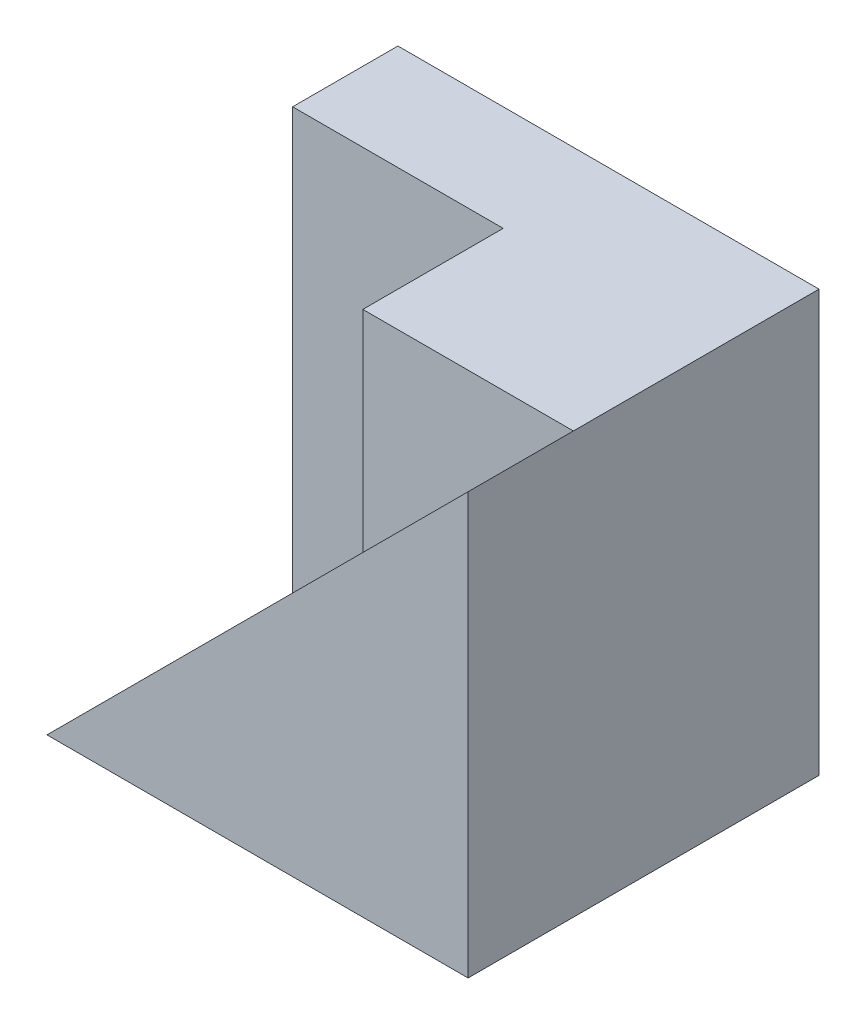
ISO-10303-21;
HEADER;
FILE_DESCRIPTION(('STEP AP214'),'2;1');
FILE_NAME('part.step','',(''),(''),'','','');
FILE_SCHEMA(('AUTOMOTIVE_DESIGN { 1 0 10303 214 1 1 1 1 }'));
ENDSEC;
DATA;
#1=APPLICATION_CONTEXT('core data for automotive mechanical design processes');
#2=APPLICATION_PROTOCOL_DEFINITION('international standard','automotive_design',2000,#1);
#3=PRODUCT_CONTEXT('',#1,'mechanical');
#4=PRODUCT('Part','Part','',(#3));
#5=PRODUCT_RELATED_PRODUCT_CATEGORY('part','',(#4));
#6=PRODUCT_DEFINITION_FORMATION('','',#4);
#7=PRODUCT_DEFINITION_CONTEXT('part definition',#1,'design');
#8=PRODUCT_DEFINITION('design','',#6,#7);
#9=PRODUCT_DEFINITION_SHAPE('','',#8);
#10=(LENGTH_UNIT() NAMED_UNIT(*) SI_UNIT(.MILLI.,.METRE.));
#11=(NAMED_UNIT(*) PLANE_ANGLE_UNIT() SI_UNIT($,.RADIAN.));
#12=(NAMED_UNIT(*) SI_UNIT($,.STERADIAN.) SOLID_ANGLE_UNIT());
#13=UNCERTAINTY_MEASURE_WITH_UNIT(LENGTH_MEASURE(1.E-05),#10,'distance_accuracy_value','');
#14=(GEOMETRIC_REPRESENTATION_CONTEXT(3) GLOBAL_UNCERTAINTY_ASSIGNED_CONTEXT((#13)) GLOBAL_UNIT_ASSIGNED_CONTEXT((#10,
#11,#12)) REPRESENTATION_CONTEXT('',''));
#15=CARTESIAN_POINT('',(0.,0.,0.));
#16=DIRECTION('',(0.,0.,1.));
#17=DIRECTION('',(1.,0.,0.));
#18=AXIS2_PLACEMENT_3D('',#15,#16,#17);
#19=CARTESIAN_POINT('',(-3.,6.,2.5));
#20=DIRECTION('',(1.,0.,0.));
#21=DIRECTION('',(0.,0.,-1.));
#22=AXIS2_PLACEMENT_3D('',#19,#20,#21);
#23=PLANE('',#22);
#24=DIRECTION('',(0.,-1.,0.));
#25=VECTOR('',#24,1.);
#26=CARTESIAN_POINT('',(-3.,0.,-1.));
#27=LINE('',#26,#25);
#28=CARTESIAN_POINT('',(-3.,6.,-1.));
#29=VERTEX_POINT('',#28);
#30=CARTESIAN_POINT('',(-3.,0.,-1.));
#31=VERTEX_POINT('',#30);
#32=EDGE_CURVE('E118',#29,#31,#27,.T.);
#33=ORIENTED_EDGE('',*,*,#32,.F.);
#34=DIRECTION('',(0.,0.,1.));
#35=VECTOR('',#34,1.);
#36=CARTESIAN_POINT('',(-3.,6.,2.5));
#37=LINE('',#36,#35);
#38=CARTESIAN_POINT('',(-3.,6.,-2.5));
#39=VERTEX_POINT('',#38);
#40=EDGE_CURVE('E132',#39,#29,#37,.T.);
#41=ORIENTED_EDGE('',*,*,#40,.F.);
#42=DIRECTION('',(0.,-1.,0.));
#43=VECTOR('',#42,1.);
#44=CARTESIAN_POINT('',(-3.,6.,-2.5));
#45=LINE('',#44,#43);
#46=CARTESIAN_POINT('',(-3.,0.,-2.5));
#47=VERTEX_POINT('',#46);
#48=EDGE_CURVE('E146',#39,#47,#45,.T.);
#49=ORIENTED_EDGE('',*,*,#48,.T.);
#50=DIRECTION('',(0.,0.,1.));
#51=VECTOR('',#50,1.);
#52=CARTESIAN_POINT('',(-3.,0.,2.5));
#53=LINE('',#52,#51);
#54=EDGE_CURVE('E139',#47,#31,#53,.T.);
#55=ORIENTED_EDGE('',*,*,#54,.T.);
#56=EDGE_LOOP('',(#33,#41,#49,#55));
#57=FACE_BOUND('',#56,.T.);
#58=ADVANCED_FACE('F35',(#57),#23,.F.);
#59=CARTESIAN_POINT('',(0.,6.,0.));
#60=DIRECTION('',(0.,-1.,0.));
#61=DIRECTION('',(0.,0.,-1.));
#62=AXIS2_PLACEMENT_3D('',#59,#60,#61);
#63=PLANE('',#62);
#64=DIRECTION('',(-1.,0.,0.));
#65=VECTOR('',#64,1.);
#66=CARTESIAN_POINT('',(-3.,6.,-1.));
#67=LINE('',#66,#65);
#68=CARTESIAN_POINT('',(0.,6.,-1.));
#69=VERTEX_POINT('',#68);
#70=EDGE_CURVE('E110',#69,#29,#67,.T.);
#71=ORIENTED_EDGE('',*,*,#70,.F.);
#72=DIRECTION('',(0.,0.,1.));
#73=VECTOR('',#72,1.);
#74=CARTESIAN_POINT('',(0.,6.,-1.));
#75=LINE('',#74,#73);
#76=CARTESIAN_POINT('',(0.,6.,1.));
#77=VERTEX_POINT('',#76);
#78=EDGE_CURVE('E98',#69,#77,#75,.T.);
#79=ORIENTED_EDGE('',*,*,#78,.T.);
#80=DIRECTION('',(1.,0.,0.));
#81=VECTOR('',#80,1.);
#82=CARTESIAN_POINT('',(0.,6.,1.));
#83=LINE('',#82,#81);
#84=CARTESIAN_POINT('',(3.,6.,1.));
#85=VERTEX_POINT('',#84);
#86=EDGE_CURVE('E104',#77,#85,#83,.T.);
#87=ORIENTED_EDGE('',*,*,#86,.T.);
#88=DIRECTION('',(0.,0.,-1.));
#89=VECTOR('',#88,1.);
#90=CARTESIAN_POINT('',(3.,6.,2.5));
#91=LINE('',#90,#89);
#92=CARTESIAN_POINT('',(3.,6.,-2.5));
#93=VERTEX_POINT('',#92);
#94=EDGE_CURVE('E56',#85,#93,#91,.T.);
#95=ORIENTED_EDGE('',*,*,#94,.T.);
#96=DIRECTION('',(-1.,0.,0.));
#97=VECTOR('',#96,1.);
#98=CARTESIAN_POINT('',(-3.,6.,-2.5));
#99=LINE('',#98,#97);
#100=EDGE_CURVE('E130',#93,#39,#99,.T.);
#101=ORIENTED_EDGE('',*,*,#100,.T.);
#102=ORIENTED_EDGE('',*,*,#40,.T.);
#103=EDGE_LOOP('',(#71,#79,#87,#95,#101,#102));
#104=FACE_BOUND('',#103,.T.);
#105=ADVANCED_FACE('F108',(#104),#63,.F.);
#106=CARTESIAN_POINT('',(3.,6.,2.5));
#107=DIRECTION('',(-1.,0.,0.));
#108=DIRECTION('',(0.,0.,1.));
#109=AXIS2_PLACEMENT_3D('',#106,#107,#108);
#110=PLANE('',#109);
#111=ORIENTED_EDGE('',*,*,#94,.F.);
#112=CARTESIAN_POINT('',(3.,6.,2.5));
#113=VERTEX_POINT('',#112);
#114=EDGE_CURVE('E128',#113,#85,#91,.T.);
#115=ORIENTED_EDGE('',*,*,#114,.F.);
#116=DIRECTION('',(0.,-1.,0.));
#117=VECTOR('',#116,1.);
#118=CARTESIAN_POINT('',(3.,6.,2.5));
#119=LINE('',#118,#117);
#120=CARTESIAN_POINT('',(3.,0.,2.5));
#121=VERTEX_POINT('',#120);
#122=EDGE_CURVE('E134',#113,#121,#119,.T.);
#123=ORIENTED_EDGE('',*,*,#122,.T.);
#124=DIRECTION('',(0.,0.,-1.));
#125=VECTOR('',#124,1.);
#126=CARTESIAN_POINT('',(3.,0.,2.5));
#127=LINE('',#126,#125);
#128=CARTESIAN_POINT('',(3.,0.,-2.5));
#129=VERTEX_POINT('',#128);
#130=EDGE_CURVE('E127',#121,#129,#127,.T.);
#131=ORIENTED_EDGE('',*,*,#130,.T.);
#132=DIRECTION('',(0.,-1.,0.));
#133=VECTOR('',#132,1.);
#134=CARTESIAN_POINT('',(3.,6.,-2.5));
#135=LINE('',#134,#133);
#136=EDGE_CURVE('E43',#93,#129,#135,.T.);
#137=ORIENTED_EDGE('',*,*,#136,.F.);
#138=EDGE_LOOP('',(#111,#115,#123,#131,#137));
#139=FACE_BOUND('',#138,.T.);
#140=ADVANCED_FACE('F37',(#139),#110,.F.);
#141=CARTESIAN_POINT('',(-3.,6.,-2.5));
#142=DIRECTION('',(0.,0.,1.));
#143=DIRECTION('',(1.,0.,0.));
#144=AXIS2_PLACEMENT_3D('',#141,#142,#143);
#145=PLANE('',#144);
#146=DIRECTION('',(-1.,0.,0.));
#147=VECTOR('',#146,1.);
#148=CARTESIAN_POINT('',(-3.,0.,-2.5));
#149=LINE('',#148,#147);
#150=EDGE_CURVE('E137',#129,#47,#149,.T.);
#151=ORIENTED_EDGE('',*,*,#150,.T.);
#152=ORIENTED_EDGE('',*,*,#48,.F.);
#153=ORIENTED_EDGE('',*,*,#100,.F.);
#154=ORIENTED_EDGE('',*,*,#136,.T.);
#155=EDGE_LOOP('',(#151,#152,#153,#154));
#156=FACE_BOUND('',#155,.T.);
#157=ADVANCED_FACE('F151',(#156),#145,.F.);
#158=CARTESIAN_POINT('',(-3.,6.,2.5));
#159=DIRECTION('',(0.,0.,-1.));
#160=DIRECTION('',(-1.,0.,0.));
#161=AXIS2_PLACEMENT_3D('',#158,#159,#160);
#162=PLANE('',#161);
#163=ORIENTED_EDGE('',*,*,#122,.F.);
#164=DIRECTION('',(0.707106781186548,0.707106781186548,0.));
#165=VECTOR('',#164,1.);
#166=CARTESIAN_POINT('',(3.,6.,2.5));
#167=LINE('',#166,#165);
#168=CARTESIAN_POINT('',(-3.,0.,2.5));
#169=VERTEX_POINT('',#168);
#170=EDGE_CURVE('E115',#169,#113,#167,.T.);
#171=ORIENTED_EDGE('',*,*,#170,.F.);
#172=DIRECTION('',(1.,0.,0.));
#173=VECTOR('',#172,1.);
#174=CARTESIAN_POINT('',(-3.,0.,2.5));
#175=LINE('',#174,#173);
#176=EDGE_CURVE('E142',#169,#121,#175,.T.);
#177=ORIENTED_EDGE('',*,*,#176,.T.);
#178=EDGE_LOOP('',(#163,#171,#177));
#179=FACE_BOUND('',#178,.T.);
#180=ADVANCED_FACE('F168',(#179),#162,.F.);
#181=CARTESIAN_POINT('',(0.,0.,0.));
#182=DIRECTION('',(0.,-1.,0.));
#183=DIRECTION('',(0.,0.,-1.));
#184=AXIS2_PLACEMENT_3D('',#181,#182,#183);
#185=PLANE('',#184);
#186=ORIENTED_EDGE('',*,*,#130,.F.);
#187=ORIENTED_EDGE('',*,*,#176,.F.);
#188=DIRECTION('',(0.,0.,1.));
#189=VECTOR('',#188,1.);
#190=CARTESIAN_POINT('',(-3.,0.,-1.));
#191=LINE('',#190,#189);
#192=EDGE_CURVE('E124',#31,#169,#191,.T.);
#193=ORIENTED_EDGE('',*,*,#192,.F.);
#194=ORIENTED_EDGE('',*,*,#54,.F.);
#195=ORIENTED_EDGE('',*,*,#150,.F.);
#196=EDGE_LOOP('',(#186,#187,#193,#194,#195));
#197=FACE_BOUND('',#196,.T.);
#198=ADVANCED_FACE('F157',(#197),#185,.T.);
#199=CARTESIAN_POINT('',(3.,6.,-1.));
#200=DIRECTION('',(0.707106781186547,-0.707106781186547,0.));
#201=DIRECTION('',(0.707106781186548,0.707106781186548,0.));
#202=AXIS2_PLACEMENT_3D('',#199,#200,#201);
#203=PLANE('',#202);
#204=ORIENTED_EDGE('',*,*,#114,.T.);
#205=DIRECTION('',(-0.707106781186548,-0.707106781186548,0.));
#206=VECTOR('',#205,1.);
#207=CARTESIAN_POINT('',(3.,6.,1.));
#208=LINE('',#207,#206);
#209=CARTESIAN_POINT('',(0.,3.,1.));
#210=VERTEX_POINT('',#209);
#211=EDGE_CURVE('E11',#85,#210,#208,.T.);
#212=ORIENTED_EDGE('',*,*,#211,.T.);
#213=DIRECTION('',(0.,0.,1.));
#214=VECTOR('',#213,1.);
#215=CARTESIAN_POINT('',(0.,3.,-1.));
#216=LINE('',#215,#214);
#217=CARTESIAN_POINT('',(0.,3.,-1.));
#218=VERTEX_POINT('',#217);
#219=EDGE_CURVE('E99',#218,#210,#216,.T.);
#220=ORIENTED_EDGE('',*,*,#219,.F.);
#221=DIRECTION('',(0.707106781186548,0.707106781186548,0.));
#222=VECTOR('',#221,1.);
#223=CARTESIAN_POINT('',(3.,6.,-1.));
#224=LINE('',#223,#222);
#225=EDGE_CURVE('E121',#31,#218,#224,.T.);
#226=ORIENTED_EDGE('',*,*,#225,.F.);
#227=ORIENTED_EDGE('',*,*,#192,.T.);
#228=ORIENTED_EDGE('',*,*,#170,.T.);
#229=EDGE_LOOP('',(#204,#212,#220,#226,#227,#228));
#230=FACE_BOUND('',#229,.T.);
#231=ADVANCED_FACE('F165',(#230),#203,.F.);
#232=CARTESIAN_POINT('',(0.,0.,-1.));
#233=DIRECTION('',(0.,0.,1.));
#234=DIRECTION('',(1.,0.,0.));
#235=AXIS2_PLACEMENT_3D('',#232,#233,#234);
#236=PLANE('',#235);
#237=DIRECTION('',(0.,1.,0.));
#238=VECTOR('',#237,1.);
#239=CARTESIAN_POINT('',(0.,3.,-1.));
#240=LINE('',#239,#238);
#241=EDGE_CURVE('E101',#218,#69,#240,.T.);
#242=ORIENTED_EDGE('',*,*,#241,.T.);
#243=ORIENTED_EDGE('',*,*,#70,.T.);
#244=ORIENTED_EDGE('',*,*,#32,.T.);
#245=ORIENTED_EDGE('',*,*,#225,.T.);
#246=EDGE_LOOP('',(#242,#243,#244,#245));
#247=FACE_BOUND('',#246,.T.);
#248=ADVANCED_FACE('F164',(#247),#236,.T.);
#249=CARTESIAN_POINT('',(0.,3.,1.));
#250=DIRECTION('',(0.,0.,1.));
#251=DIRECTION('',(1.,0.,0.));
#252=AXIS2_PLACEMENT_3D('',#249,#250,#251);
#253=PLANE('',#252);
#254=ORIENTED_EDGE('',*,*,#211,.F.);
#255=ORIENTED_EDGE('',*,*,#86,.F.);
#256=DIRECTION('',(0.,1.,0.));
#257=VECTOR('',#256,1.);
#258=CARTESIAN_POINT('',(0.,3.,1.));
#259=LINE('',#258,#257);
#260=EDGE_CURVE('E93',#210,#77,#259,.T.);
#261=ORIENTED_EDGE('',*,*,#260,.F.);
#262=EDGE_LOOP('',(#254,#255,#261));
#263=FACE_BOUND('',#262,.T.);
#264=ADVANCED_FACE('F105',(#263),#253,.T.);
#265=CARTESIAN_POINT('',(0.,3.,-1.));
#266=DIRECTION('',(-1.,0.,0.));
#267=DIRECTION('',(0.,0.,1.));
#268=AXIS2_PLACEMENT_3D('',#265,#266,#267);
#269=PLANE('',#268);
#270=ORIENTED_EDGE('',*,*,#78,.F.);
#271=ORIENTED_EDGE('',*,*,#241,.F.);
#272=ORIENTED_EDGE('',*,*,#219,.T.);
#273=ORIENTED_EDGE('',*,*,#260,.T.);
#274=EDGE_LOOP('',(#270,#271,#272,#273));
#275=FACE_BOUND('',#274,.T.);
#276=ADVANCED_FACE('F95',(#275),#269,.T.);
#277=CLOSED_SHELL('',(#58,#105,#140,#157,#180,#198,#231,#248,#264,#276));
#278=MANIFOLD_SOLID_BREP('B2',#277);
#279=ADVANCED_BREP_SHAPE_REPRESENTATION('',(#18,#278),#14);
#280=SHAPE_DEFINITION_REPRESENTATION(#9,#279);
ENDSEC;
END-ISO-10303-21;
